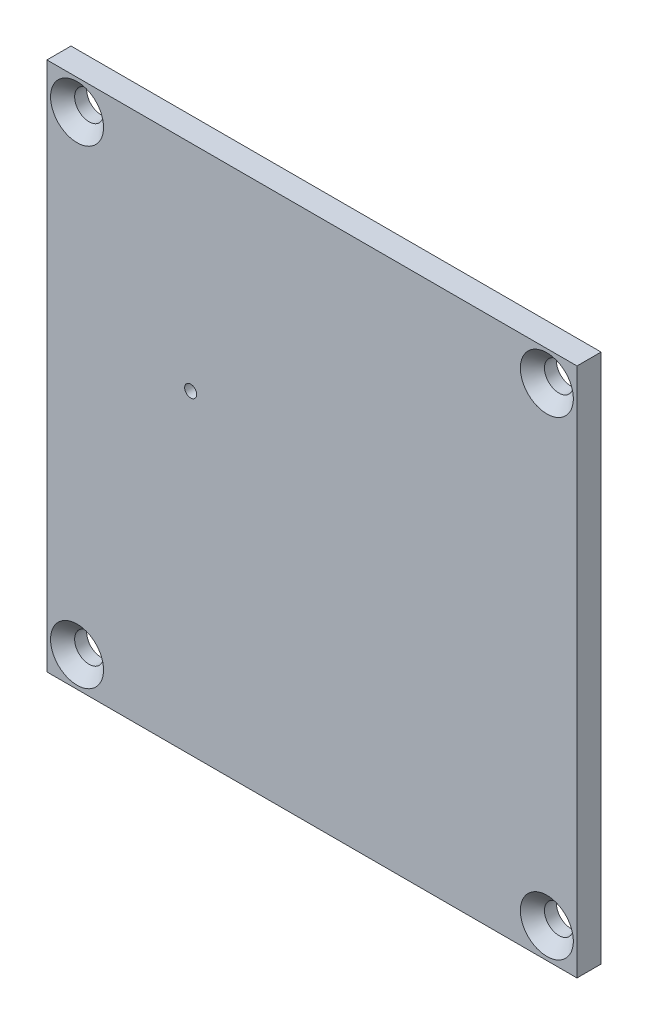
ISO-10303-21;
HEADER;
FILE_DESCRIPTION(('STEP AP214'),'2;1');
FILE_NAME('part.step','',(''),(''),'','','');
FILE_SCHEMA(('AUTOMOTIVE_DESIGN { 1 0 10303 214 1 1 1 1 }'));
ENDSEC;
DATA;
#1=APPLICATION_CONTEXT('core data for automotive mechanical design processes');
#2=APPLICATION_PROTOCOL_DEFINITION('international standard','automotive_design',2000,#1);
#3=PRODUCT_CONTEXT('',#1,'mechanical');
#4=PRODUCT('Part','Part','',(#3));
#5=PRODUCT_RELATED_PRODUCT_CATEGORY('part','',(#4));
#6=PRODUCT_DEFINITION_FORMATION('','',#4);
#7=PRODUCT_DEFINITION_CONTEXT('part definition',#1,'design');
#8=PRODUCT_DEFINITION('design','',#6,#7);
#9=PRODUCT_DEFINITION_SHAPE('','',#8);
#10=(LENGTH_UNIT() NAMED_UNIT(*) SI_UNIT(.MILLI.,.METRE.));
#11=(NAMED_UNIT(*) PLANE_ANGLE_UNIT() SI_UNIT($,.RADIAN.));
#12=(NAMED_UNIT(*) SI_UNIT($,.STERADIAN.) SOLID_ANGLE_UNIT());
#13=UNCERTAINTY_MEASURE_WITH_UNIT(LENGTH_MEASURE(1.E-05),#10,'distance_accuracy_value','');
#14=(GEOMETRIC_REPRESENTATION_CONTEXT(3) GLOBAL_UNCERTAINTY_ASSIGNED_CONTEXT((#13)) GLOBAL_UNIT_ASSIGNED_CONTEXT((#10,
#11,#12)) REPRESENTATION_CONTEXT('',''));
#15=CARTESIAN_POINT('',(0.,0.,0.));
#16=DIRECTION('',(0.,0.,1.));
#17=DIRECTION('',(1.,0.,0.));
#18=AXIS2_PLACEMENT_3D('',#15,#16,#17);
#19=CARTESIAN_POINT('',(22.,22.,2.));
#20=DIRECTION('',(0.,-1.,0.));
#21=DIRECTION('',(0.,0.,-1.));
#22=AXIS2_PLACEMENT_3D('',#19,#20,#21);
#23=PLANE('',#22);
#24=DIRECTION('',(-1.,0.,0.));
#25=VECTOR('',#24,1.);
#26=CARTESIAN_POINT('',(22.,22.,0.));
#27=LINE('',#26,#25);
#28=CARTESIAN_POINT('',(22.,22.,0.));
#29=VERTEX_POINT('',#28);
#30=CARTESIAN_POINT('',(-22.,22.,0.));
#31=VERTEX_POINT('',#30);
#32=EDGE_CURVE('E104',#29,#31,#27,.T.);
#33=ORIENTED_EDGE('',*,*,#32,.T.);
#34=DIRECTION('',(0.,0.,-1.));
#35=VECTOR('',#34,1.);
#36=CARTESIAN_POINT('',(-22.,22.,2.));
#37=LINE('',#36,#35);
#38=CARTESIAN_POINT('',(-22.,22.,2.));
#39=VERTEX_POINT('',#38);
#40=EDGE_CURVE('E11',#39,#31,#37,.T.);
#41=ORIENTED_EDGE('',*,*,#40,.F.);
#42=DIRECTION('',(-1.,0.,0.));
#43=VECTOR('',#42,1.);
#44=CARTESIAN_POINT('',(22.,22.,2.));
#45=LINE('',#44,#43);
#46=CARTESIAN_POINT('',(22.,22.,2.));
#47=VERTEX_POINT('',#46);
#48=EDGE_CURVE('E92',#47,#39,#45,.T.);
#49=ORIENTED_EDGE('',*,*,#48,.F.);
#50=DIRECTION('',(0.,0.,-1.));
#51=VECTOR('',#50,1.);
#52=CARTESIAN_POINT('',(22.,22.,2.));
#53=LINE('',#52,#51);
#54=EDGE_CURVE('E100',#47,#29,#53,.T.);
#55=ORIENTED_EDGE('',*,*,#54,.T.);
#56=EDGE_LOOP('',(#33,#41,#49,#55));
#57=FACE_BOUND('',#56,.T.);
#58=ADVANCED_FACE('F41',(#57),#23,.F.);
#59=CARTESIAN_POINT('',(-22.,-22.,2.));
#60=DIRECTION('',(1.,0.,0.));
#61=DIRECTION('',(0.,0.,-1.));
#62=AXIS2_PLACEMENT_3D('',#59,#60,#61);
#63=PLANE('',#62);
#64=DIRECTION('',(0.,-1.,0.));
#65=VECTOR('',#64,1.);
#66=CARTESIAN_POINT('',(-22.,-22.,0.));
#67=LINE('',#66,#65);
#68=CARTESIAN_POINT('',(-22.,-22.,0.));
#69=VERTEX_POINT('',#68);
#70=EDGE_CURVE('E96',#31,#69,#67,.T.);
#71=ORIENTED_EDGE('',*,*,#70,.T.);
#72=DIRECTION('',(0.,0.,-1.));
#73=VECTOR('',#72,1.);
#74=CARTESIAN_POINT('',(-22.,-22.,2.));
#75=LINE('',#74,#73);
#76=CARTESIAN_POINT('',(-22.,-22.,2.));
#77=VERTEX_POINT('',#76);
#78=EDGE_CURVE('E49',#77,#69,#75,.T.);
#79=ORIENTED_EDGE('',*,*,#78,.F.);
#80=DIRECTION('',(0.,-1.,0.));
#81=VECTOR('',#80,1.);
#82=CARTESIAN_POINT('',(-22.,-22.,2.));
#83=LINE('',#82,#81);
#84=EDGE_CURVE('E87',#39,#77,#83,.T.);
#85=ORIENTED_EDGE('',*,*,#84,.F.);
#86=ORIENTED_EDGE('',*,*,#40,.T.);
#87=EDGE_LOOP('',(#71,#79,#85,#86));
#88=FACE_BOUND('',#87,.T.);
#89=ADVANCED_FACE('F95',(#88),#63,.F.);
#90=CARTESIAN_POINT('',(22.,-22.,2.));
#91=DIRECTION('',(0.,1.,0.));
#92=DIRECTION('',(0.,0.,1.));
#93=AXIS2_PLACEMENT_3D('',#90,#91,#92);
#94=PLANE('',#93);
#95=DIRECTION('',(1.,0.,0.));
#96=VECTOR('',#95,1.);
#97=CARTESIAN_POINT('',(22.,-22.,0.));
#98=LINE('',#97,#96);
#99=CARTESIAN_POINT('',(22.,-22.,0.));
#100=VERTEX_POINT('',#99);
#101=EDGE_CURVE('E74',#69,#100,#98,.T.);
#102=ORIENTED_EDGE('',*,*,#101,.T.);
#103=DIRECTION('',(0.,0.,-1.));
#104=VECTOR('',#103,1.);
#105=CARTESIAN_POINT('',(22.,-22.,2.));
#106=LINE('',#105,#104);
#107=CARTESIAN_POINT('',(22.,-22.,2.));
#108=VERTEX_POINT('',#107);
#109=EDGE_CURVE('E97',#108,#100,#106,.T.);
#110=ORIENTED_EDGE('',*,*,#109,.F.);
#111=DIRECTION('',(1.,0.,0.));
#112=VECTOR('',#111,1.);
#113=CARTESIAN_POINT('',(22.,-22.,2.));
#114=LINE('',#113,#112);
#115=EDGE_CURVE('E90',#77,#108,#114,.T.);
#116=ORIENTED_EDGE('',*,*,#115,.F.);
#117=ORIENTED_EDGE('',*,*,#78,.T.);
#118=EDGE_LOOP('',(#102,#110,#116,#117));
#119=FACE_BOUND('',#118,.T.);
#120=ADVANCED_FACE('F98',(#119),#94,.F.);
#121=CARTESIAN_POINT('',(22.,-22.,2.));
#122=DIRECTION('',(-1.,0.,0.));
#123=DIRECTION('',(0.,0.,1.));
#124=AXIS2_PLACEMENT_3D('',#121,#122,#123);
#125=PLANE('',#124);
#126=DIRECTION('',(0.,1.,0.));
#127=VECTOR('',#126,1.);
#128=CARTESIAN_POINT('',(22.,-22.,0.));
#129=LINE('',#128,#127);
#130=EDGE_CURVE('E80',#100,#29,#129,.T.);
#131=ORIENTED_EDGE('',*,*,#130,.T.);
#132=ORIENTED_EDGE('',*,*,#54,.F.);
#133=DIRECTION('',(0.,1.,0.));
#134=VECTOR('',#133,1.);
#135=CARTESIAN_POINT('',(22.,-22.,2.));
#136=LINE('',#135,#134);
#137=EDGE_CURVE('E57',#108,#47,#136,.T.);
#138=ORIENTED_EDGE('',*,*,#137,.F.);
#139=ORIENTED_EDGE('',*,*,#109,.T.);
#140=EDGE_LOOP('',(#131,#132,#138,#139));
#141=FACE_BOUND('',#140,.T.);
#142=ADVANCED_FACE('F112',(#141),#125,.F.);
#143=CARTESIAN_POINT('',(0.,0.,2.));
#144=DIRECTION('',(0.,0.,-1.));
#145=DIRECTION('',(-1.,0.,0.));
#146=AXIS2_PLACEMENT_3D('',#143,#144,#145);
#147=PLANE('',#146);
#148=CARTESIAN_POINT('',(19.5,-19.5,2.));
#149=DIRECTION('',(0.,0.,1.));
#150=DIRECTION('',(1.,0.,0.));
#151=AXIS2_PLACEMENT_3D('',#148,#149,#150);
#152=CIRCLE('',#151,2.2);
#153=CARTESIAN_POINT('',(21.7,-19.5,2.));
#154=VERTEX_POINT('',#153);
#155=EDGE_CURVE('E156',#154,#154,#152,.T.);
#156=ORIENTED_EDGE('',*,*,#155,.F.);
#157=EDGE_LOOP('',(#156));
#158=FACE_BOUND('',#157,.T.);
#159=CARTESIAN_POINT('',(-19.5,-19.5,2.));
#160=DIRECTION('',(0.,0.,1.));
#161=DIRECTION('',(1.,0.,0.));
#162=AXIS2_PLACEMENT_3D('',#159,#160,#161);
#163=CIRCLE('',#162,2.2);
#164=CARTESIAN_POINT('',(-17.3,-19.5,2.));
#165=VERTEX_POINT('',#164);
#166=EDGE_CURVE('E147',#165,#165,#163,.T.);
#167=ORIENTED_EDGE('',*,*,#166,.F.);
#168=EDGE_LOOP('',(#167));
#169=FACE_BOUND('',#168,.T.);
#170=CARTESIAN_POINT('',(-19.5,19.5,2.));
#171=DIRECTION('',(0.,0.,1.));
#172=DIRECTION('',(1.,0.,0.));
#173=AXIS2_PLACEMENT_3D('',#170,#171,#172);
#174=CIRCLE('',#173,2.2);
#175=CARTESIAN_POINT('',(-17.3,19.5,2.));
#176=VERTEX_POINT('',#175);
#177=EDGE_CURVE('E138',#176,#176,#174,.T.);
#178=ORIENTED_EDGE('',*,*,#177,.F.);
#179=EDGE_LOOP('',(#178));
#180=FACE_BOUND('',#179,.T.);
#181=CARTESIAN_POINT('',(19.5,19.5,2.));
#182=DIRECTION('',(0.,0.,1.));
#183=DIRECTION('',(1.,0.,0.));
#184=AXIS2_PLACEMENT_3D('',#181,#182,#183);
#185=CIRCLE('',#184,2.2);
#186=CARTESIAN_POINT('',(21.7,19.5,2.));
#187=VERTEX_POINT('',#186);
#188=EDGE_CURVE('E129',#187,#187,#185,.T.);
#189=ORIENTED_EDGE('',*,*,#188,.F.);
#190=EDGE_LOOP('',(#189));
#191=FACE_BOUND('',#190,.T.);
#192=CARTESIAN_POINT('',(-10.0676540105553,4.16018437454113,2.));
#193=DIRECTION('',(0.,0.,1.));
#194=DIRECTION('',(1.,0.,0.));
#195=AXIS2_PLACEMENT_3D('',#192,#193,#194);
#196=CIRCLE('',#195,0.500000000000001);
#197=CARTESIAN_POINT('',(-9.56765401055532,4.16018437454113,2.));
#198=VERTEX_POINT('',#197);
#199=EDGE_CURVE('E118',#198,#198,#196,.T.);
#200=ORIENTED_EDGE('',*,*,#199,.F.);
#201=EDGE_LOOP('',(#200));
#202=FACE_BOUND('',#201,.T.);
#203=ORIENTED_EDGE('',*,*,#48,.T.);
#204=ORIENTED_EDGE('',*,*,#84,.T.);
#205=ORIENTED_EDGE('',*,*,#115,.T.);
#206=ORIENTED_EDGE('',*,*,#137,.T.);
#207=EDGE_LOOP('',(#203,#204,#205,#206));
#208=FACE_BOUND('',#207,.T.);
#209=ADVANCED_FACE('F88',(#158,#169,#180,#191,#202,#208),#147,.F.);
#210=CARTESIAN_POINT('',(0.,0.,0.));
#211=DIRECTION('',(0.,0.,-1.));
#212=DIRECTION('',(-1.,0.,0.));
#213=AXIS2_PLACEMENT_3D('',#210,#211,#212);
#214=PLANE('',#213);
#215=CARTESIAN_POINT('',(19.5,-19.5,0.));
#216=DIRECTION('',(0.,0.,1.));
#217=DIRECTION('',(1.,0.,0.));
#218=AXIS2_PLACEMENT_3D('',#215,#216,#217);
#219=CIRCLE('',#218,1.2);
#220=CARTESIAN_POINT('',(20.7,-19.5,0.));
#221=VERTEX_POINT('',#220);
#222=EDGE_CURVE('E150',#221,#221,#219,.T.);
#223=ORIENTED_EDGE('',*,*,#222,.T.);
#224=EDGE_LOOP('',(#223));
#225=FACE_BOUND('',#224,.T.);
#226=CARTESIAN_POINT('',(-19.5,-19.5,0.));
#227=DIRECTION('',(0.,0.,1.));
#228=DIRECTION('',(1.,0.,0.));
#229=AXIS2_PLACEMENT_3D('',#226,#227,#228);
#230=CIRCLE('',#229,1.2);
#231=CARTESIAN_POINT('',(-18.3,-19.5,0.));
#232=VERTEX_POINT('',#231);
#233=EDGE_CURVE('E141',#232,#232,#230,.T.);
#234=ORIENTED_EDGE('',*,*,#233,.T.);
#235=EDGE_LOOP('',(#234));
#236=FACE_BOUND('',#235,.T.);
#237=CARTESIAN_POINT('',(-19.5,19.5,0.));
#238=DIRECTION('',(0.,0.,1.));
#239=DIRECTION('',(1.,0.,0.));
#240=AXIS2_PLACEMENT_3D('',#237,#238,#239);
#241=CIRCLE('',#240,1.2);
#242=CARTESIAN_POINT('',(-18.3,19.5,0.));
#243=VERTEX_POINT('',#242);
#244=EDGE_CURVE('E132',#243,#243,#241,.T.);
#245=ORIENTED_EDGE('',*,*,#244,.T.);
#246=EDGE_LOOP('',(#245));
#247=FACE_BOUND('',#246,.T.);
#248=CARTESIAN_POINT('',(19.5,19.5,0.));
#249=DIRECTION('',(0.,0.,1.));
#250=DIRECTION('',(1.,0.,0.));
#251=AXIS2_PLACEMENT_3D('',#248,#249,#250);
#252=CIRCLE('',#251,1.2);
#253=CARTESIAN_POINT('',(20.7,19.5,0.));
#254=VERTEX_POINT('',#253);
#255=EDGE_CURVE('E121',#254,#254,#252,.T.);
#256=ORIENTED_EDGE('',*,*,#255,.T.);
#257=EDGE_LOOP('',(#256));
#258=FACE_BOUND('',#257,.T.);
#259=CARTESIAN_POINT('',(-10.0676540105553,4.16018437454113,0.));
#260=DIRECTION('',(0.,0.,1.));
#261=DIRECTION('',(1.,0.,0.));
#262=AXIS2_PLACEMENT_3D('',#259,#260,#261);
#263=CIRCLE('',#262,0.500000000000001);
#264=CARTESIAN_POINT('',(-9.56765401055532,4.16018437454113,0.));
#265=VERTEX_POINT('',#264);
#266=EDGE_CURVE('E107',#265,#265,#263,.T.);
#267=ORIENTED_EDGE('',*,*,#266,.T.);
#268=EDGE_LOOP('',(#267));
#269=FACE_BOUND('',#268,.T.);
#270=ORIENTED_EDGE('',*,*,#32,.F.);
#271=ORIENTED_EDGE('',*,*,#130,.F.);
#272=ORIENTED_EDGE('',*,*,#101,.F.);
#273=ORIENTED_EDGE('',*,*,#70,.F.);
#274=EDGE_LOOP('',(#270,#271,#272,#273));
#275=FACE_BOUND('',#274,.T.);
#276=ADVANCED_FACE('F115',(#225,#236,#247,#258,#269,#275),#214,.T.);
#277=CARTESIAN_POINT('',(-10.0676540105553,4.16018437454113,0.));
#278=DIRECTION('',(0.,0.,1.));
#279=DIRECTION('',(1.,0.,0.));
#280=AXIS2_PLACEMENT_3D('',#277,#278,#279);
#281=CYLINDRICAL_SURFACE('',#280,0.500000000000001);
#282=ORIENTED_EDGE('',*,*,#266,.F.);
#283=EDGE_LOOP('',(#282));
#284=FACE_BOUND('',#283,.T.);
#285=ORIENTED_EDGE('',*,*,#199,.T.);
#286=EDGE_LOOP('',(#285));
#287=FACE_BOUND('',#286,.T.);
#288=ADVANCED_FACE('F173',(#284,#287),#281,.F.);
#289=CARTESIAN_POINT('',(19.5,19.5,2.));
#290=DIRECTION('',(0.,0.,1.));
#291=DIRECTION('',(1.,0.,0.));
#292=AXIS2_PLACEMENT_3D('',#289,#290,#291);
#293=CYLINDRICAL_SURFACE('',#292,1.2);
#294=ORIENTED_EDGE('',*,*,#255,.F.);
#295=EDGE_LOOP('',(#294));
#296=FACE_BOUND('',#295,.T.);
#297=CARTESIAN_POINT('',(19.5,19.5,0.999999999999999));
#298=DIRECTION('',(0.,0.,1.));
#299=DIRECTION('',(1.,0.,0.));
#300=AXIS2_PLACEMENT_3D('',#297,#298,#299);
#301=CIRCLE('',#300,1.2);
#302=CARTESIAN_POINT('',(20.7,19.5,0.999999999999999));
#303=VERTEX_POINT('',#302);
#304=EDGE_CURVE('E126',#303,#303,#301,.T.);
#305=ORIENTED_EDGE('',*,*,#304,.T.);
#306=EDGE_LOOP('',(#305));
#307=FACE_BOUND('',#306,.T.);
#308=ADVANCED_FACE('F175',(#296,#307),#293,.F.);
#309=CARTESIAN_POINT('',(19.5,19.5,2.));
#310=DIRECTION('',(0.,0.,1.));
#311=DIRECTION('',(1.,0.,0.));
#312=AXIS2_PLACEMENT_3D('',#309,#310,#311);
#313=CONICAL_SURFACE('',#312,2.2,0.785398163397447);
#314=ORIENTED_EDGE('',*,*,#304,.F.);
#315=EDGE_LOOP('',(#314));
#316=FACE_BOUND('',#315,.T.);
#317=ORIENTED_EDGE('',*,*,#188,.T.);
#318=EDGE_LOOP('',(#317));
#319=FACE_BOUND('',#318,.T.);
#320=ADVANCED_FACE('F183',(#316,#319),#313,.F.);
#321=CARTESIAN_POINT('',(-19.5,19.5,2.));
#322=DIRECTION('',(0.,0.,1.));
#323=DIRECTION('',(1.,0.,0.));
#324=AXIS2_PLACEMENT_3D('',#321,#322,#323);
#325=CYLINDRICAL_SURFACE('',#324,1.2);
#326=ORIENTED_EDGE('',*,*,#244,.F.);
#327=EDGE_LOOP('',(#326));
#328=FACE_BOUND('',#327,.T.);
#329=CARTESIAN_POINT('',(-19.5,19.5,0.999999999999999));
#330=DIRECTION('',(0.,0.,1.));
#331=DIRECTION('',(1.,0.,0.));
#332=AXIS2_PLACEMENT_3D('',#329,#330,#331);
#333=CIRCLE('',#332,1.2);
#334=CARTESIAN_POINT('',(-18.3,19.5,0.999999999999999));
#335=VERTEX_POINT('',#334);
#336=EDGE_CURVE('E135',#335,#335,#333,.T.);
#337=ORIENTED_EDGE('',*,*,#336,.T.);
#338=EDGE_LOOP('',(#337));
#339=FACE_BOUND('',#338,.T.);
#340=ADVANCED_FACE('F252',(#328,#339),#325,.F.);
#341=CARTESIAN_POINT('',(-19.5,19.5,2.));
#342=DIRECTION('',(0.,0.,1.));
#343=DIRECTION('',(1.,0.,0.));
#344=AXIS2_PLACEMENT_3D('',#341,#342,#343);
#345=CONICAL_SURFACE('',#344,2.2,0.785398163397447);
#346=ORIENTED_EDGE('',*,*,#336,.F.);
#347=EDGE_LOOP('',(#346));
#348=FACE_BOUND('',#347,.T.);
#349=ORIENTED_EDGE('',*,*,#177,.T.);
#350=EDGE_LOOP('',(#349));
#351=FACE_BOUND('',#350,.T.);
#352=ADVANCED_FACE('F261',(#348,#351),#345,.F.);
#353=CARTESIAN_POINT('',(-19.5,-19.5,2.));
#354=DIRECTION('',(0.,0.,1.));
#355=DIRECTION('',(1.,0.,0.));
#356=AXIS2_PLACEMENT_3D('',#353,#354,#355);
#357=CYLINDRICAL_SURFACE('',#356,1.2);
#358=ORIENTED_EDGE('',*,*,#233,.F.);
#359=EDGE_LOOP('',(#358));
#360=FACE_BOUND('',#359,.T.);
#361=CARTESIAN_POINT('',(-19.5,-19.5,0.999999999999999));
#362=DIRECTION('',(0.,0.,1.));
#363=DIRECTION('',(1.,0.,0.));
#364=AXIS2_PLACEMENT_3D('',#361,#362,#363);
#365=CIRCLE('',#364,1.2);
#366=CARTESIAN_POINT('',(-18.3,-19.5,0.999999999999999));
#367=VERTEX_POINT('',#366);
#368=EDGE_CURVE('E144',#367,#367,#365,.T.);
#369=ORIENTED_EDGE('',*,*,#368,.T.);
#370=EDGE_LOOP('',(#369));
#371=FACE_BOUND('',#370,.T.);
#372=ADVANCED_FACE('F270',(#360,#371),#357,.F.);
#373=CARTESIAN_POINT('',(-19.5,-19.5,2.));
#374=DIRECTION('',(0.,0.,1.));
#375=DIRECTION('',(1.,0.,0.));
#376=AXIS2_PLACEMENT_3D('',#373,#374,#375);
#377=CONICAL_SURFACE('',#376,2.2,0.785398163397447);
#378=ORIENTED_EDGE('',*,*,#368,.F.);
#379=EDGE_LOOP('',(#378));
#380=FACE_BOUND('',#379,.T.);
#381=ORIENTED_EDGE('',*,*,#166,.T.);
#382=EDGE_LOOP('',(#381));
#383=FACE_BOUND('',#382,.T.);
#384=ADVANCED_FACE('F279',(#380,#383),#377,.F.);
#385=CARTESIAN_POINT('',(19.5,-19.5,2.));
#386=DIRECTION('',(0.,0.,1.));
#387=DIRECTION('',(1.,0.,0.));
#388=AXIS2_PLACEMENT_3D('',#385,#386,#387);
#389=CYLINDRICAL_SURFACE('',#388,1.2);
#390=ORIENTED_EDGE('',*,*,#222,.F.);
#391=EDGE_LOOP('',(#390));
#392=FACE_BOUND('',#391,.T.);
#393=CARTESIAN_POINT('',(19.5,-19.5,0.999999999999999));
#394=DIRECTION('',(0.,0.,1.));
#395=DIRECTION('',(1.,0.,0.));
#396=AXIS2_PLACEMENT_3D('',#393,#394,#395);
#397=CIRCLE('',#396,1.2);
#398=CARTESIAN_POINT('',(20.7,-19.5,0.999999999999999));
#399=VERTEX_POINT('',#398);
#400=EDGE_CURVE('E153',#399,#399,#397,.T.);
#401=ORIENTED_EDGE('',*,*,#400,.T.);
#402=EDGE_LOOP('',(#401));
#403=FACE_BOUND('',#402,.T.);
#404=ADVANCED_FACE('F288',(#392,#403),#389,.F.);
#405=CARTESIAN_POINT('',(19.5,-19.5,2.));
#406=DIRECTION('',(0.,0.,1.));
#407=DIRECTION('',(1.,0.,0.));
#408=AXIS2_PLACEMENT_3D('',#405,#406,#407);
#409=CONICAL_SURFACE('',#408,2.2,0.785398163397447);
#410=ORIENTED_EDGE('',*,*,#400,.F.);
#411=EDGE_LOOP('',(#410));
#412=FACE_BOUND('',#411,.T.);
#413=ORIENTED_EDGE('',*,*,#155,.T.);
#414=EDGE_LOOP('',(#413));
#415=FACE_BOUND('',#414,.T.);
#416=ADVANCED_FACE('F160',(#412,#415),#409,.F.);
#417=CLOSED_SHELL('',(#58,#89,#120,#142,#209,#276,#288,#308,#320,#340,#352,#372,#384,#404,#416));
#418=MANIFOLD_SOLID_BREP('B2',#417);
#419=ADVANCED_BREP_SHAPE_REPRESENTATION('',(#18,#418),#14);
#420=SHAPE_DEFINITION_REPRESENTATION(#9,#419);
ENDSEC;
END-ISO-10303-21;
